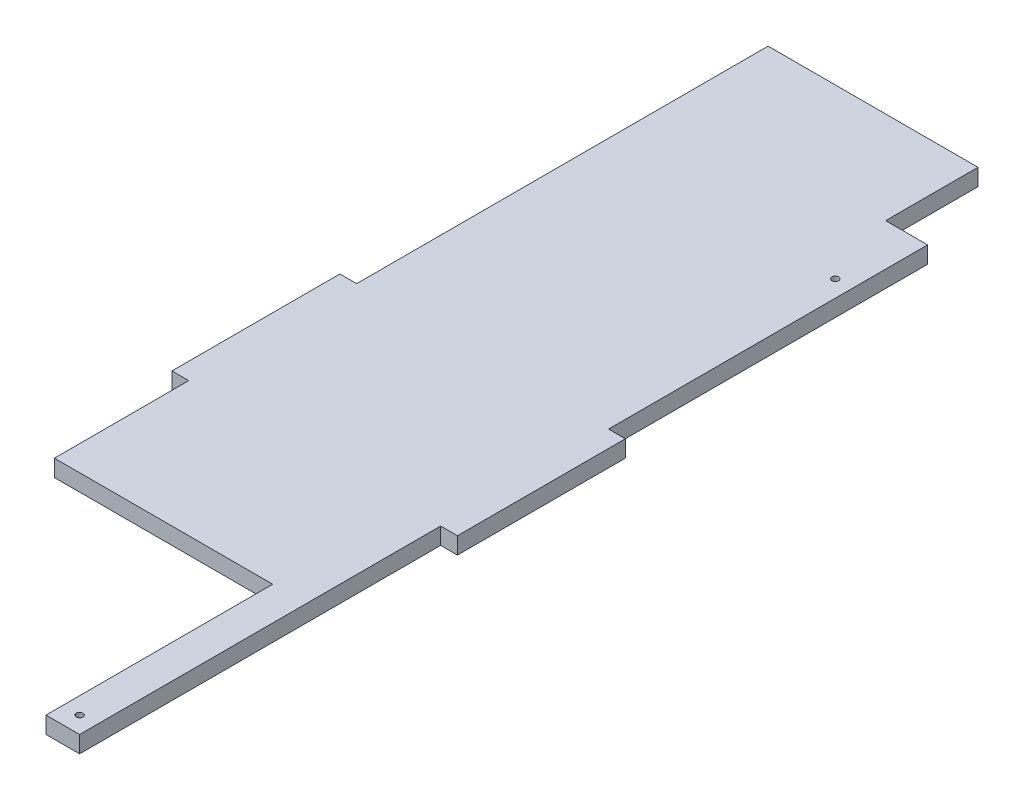
ISO-10303-21;
HEADER;
FILE_DESCRIPTION(('STEP AP214'),'2;1');
FILE_NAME('part.step','',(''),(''),'','','');
FILE_SCHEMA(('AUTOMOTIVE_DESIGN { 1 0 10303 214 1 1 1 1 }'));
ENDSEC;
DATA;
#1=APPLICATION_CONTEXT('core data for automotive mechanical design processes');
#2=APPLICATION_PROTOCOL_DEFINITION('international standard','automotive_design',2000,#1);
#3=PRODUCT_CONTEXT('',#1,'mechanical');
#4=PRODUCT('Part','Part','',(#3));
#5=PRODUCT_RELATED_PRODUCT_CATEGORY('part','',(#4));
#6=PRODUCT_DEFINITION_FORMATION('','',#4);
#7=PRODUCT_DEFINITION_CONTEXT('part definition',#1,'design');
#8=PRODUCT_DEFINITION('design','',#6,#7);
#9=PRODUCT_DEFINITION_SHAPE('','',#8);
#10=(LENGTH_UNIT() NAMED_UNIT(*) SI_UNIT(.MILLI.,.METRE.));
#11=(NAMED_UNIT(*) PLANE_ANGLE_UNIT() SI_UNIT($,.RADIAN.));
#12=(NAMED_UNIT(*) SI_UNIT($,.STERADIAN.) SOLID_ANGLE_UNIT());
#13=UNCERTAINTY_MEASURE_WITH_UNIT(LENGTH_MEASURE(1.E-05),#10,'distance_accuracy_value','');
#14=(GEOMETRIC_REPRESENTATION_CONTEXT(3) GLOBAL_UNCERTAINTY_ASSIGNED_CONTEXT((#13)) GLOBAL_UNIT_ASSIGNED_CONTEXT((#10,
#11,#12)) REPRESENTATION_CONTEXT('',''));
#15=CARTESIAN_POINT('',(0.,0.,0.));
#16=DIRECTION('',(0.,0.,1.));
#17=DIRECTION('',(1.,0.,0.));
#18=AXIS2_PLACEMENT_3D('',#15,#16,#17);
#19=CARTESIAN_POINT('',(-75.,10.,-215.));
#20=DIRECTION('',(0.,0.,-1.));
#21=DIRECTION('',(-1.,0.,0.));
#22=AXIS2_PLACEMENT_3D('',#19,#20,#21);
#23=PLANE('',#22);
#24=DIRECTION('',(1.,0.,0.));
#25=VECTOR('',#24,1.);
#26=CARTESIAN_POINT('',(-75.,0.,-215.));
#27=LINE('',#26,#25);
#28=CARTESIAN_POINT('',(-85.,0.,-215.));
#29=VERTEX_POINT('',#28);
#30=CARTESIAN_POINT('',(-75.,0.,-215.));
#31=VERTEX_POINT('',#30);
#32=EDGE_CURVE('E174',#29,#31,#27,.T.);
#33=ORIENTED_EDGE('',*,*,#32,.T.);
#34=DIRECTION('',(0.,-1.,0.));
#35=VECTOR('',#34,1.);
#36=CARTESIAN_POINT('',(-75.,10.,-215.));
#37=LINE('',#36,#35);
#38=CARTESIAN_POINT('',(-75.,10.,-215.));
#39=VERTEX_POINT('',#38);
#40=EDGE_CURVE('E11',#39,#31,#37,.T.);
#41=ORIENTED_EDGE('',*,*,#40,.F.);
#42=DIRECTION('',(1.,0.,0.));
#43=VECTOR('',#42,1.);
#44=CARTESIAN_POINT('',(-75.,10.,-215.));
#45=LINE('',#44,#43);
#46=CARTESIAN_POINT('',(-85.,10.,-215.));
#47=VERTEX_POINT('',#46);
#48=EDGE_CURVE('E203',#47,#39,#45,.T.);
#49=ORIENTED_EDGE('',*,*,#48,.F.);
#50=DIRECTION('',(0.,-1.,0.));
#51=VECTOR('',#50,1.);
#52=CARTESIAN_POINT('',(-85.,10.,-215.));
#53=LINE('',#52,#51);
#54=EDGE_CURVE('E170',#47,#29,#53,.T.);
#55=ORIENTED_EDGE('',*,*,#54,.T.);
#56=EDGE_LOOP('',(#33,#41,#49,#55));
#57=FACE_BOUND('',#56,.T.);
#58=ADVANCED_FACE('F34',(#57),#23,.F.);
#59=CARTESIAN_POINT('',(-75.,10.,-215.));
#60=DIRECTION('',(1.,0.,0.));
#61=DIRECTION('',(0.,0.,-1.));
#62=AXIS2_PLACEMENT_3D('',#59,#60,#61);
#63=PLANE('',#62);
#64=DIRECTION('',(0.,0.,1.));
#65=VECTOR('',#64,1.);
#66=CARTESIAN_POINT('',(-75.,0.,-215.));
#67=LINE('',#66,#65);
#68=CARTESIAN_POINT('',(-75.,0.,-135.));
#69=VERTEX_POINT('',#68);
#70=EDGE_CURVE('E177',#31,#69,#67,.T.);
#71=ORIENTED_EDGE('',*,*,#70,.T.);
#72=DIRECTION('',(0.,-1.,0.));
#73=VECTOR('',#72,1.);
#74=CARTESIAN_POINT('',(-75.,10.,-135.));
#75=LINE('',#74,#73);
#76=CARTESIAN_POINT('',(-75.,10.,-135.));
#77=VERTEX_POINT('',#76);
#78=EDGE_CURVE('E41',#77,#69,#75,.T.);
#79=ORIENTED_EDGE('',*,*,#78,.F.);
#80=DIRECTION('',(0.,0.,1.));
#81=VECTOR('',#80,1.);
#82=CARTESIAN_POINT('',(-75.,10.,-215.));
#83=LINE('',#82,#81);
#84=EDGE_CURVE('E113',#39,#77,#83,.T.);
#85=ORIENTED_EDGE('',*,*,#84,.F.);
#86=ORIENTED_EDGE('',*,*,#40,.T.);
#87=EDGE_LOOP('',(#71,#79,#85,#86));
#88=FACE_BOUND('',#87,.T.);
#89=ADVANCED_FACE('F303',(#88),#63,.F.);
#90=CARTESIAN_POINT('',(55.,10.,-135.));
#91=DIRECTION('',(0.,0.,-1.));
#92=DIRECTION('',(-1.,0.,0.));
#93=AXIS2_PLACEMENT_3D('',#90,#91,#92);
#94=PLANE('',#93);
#95=DIRECTION('',(1.,0.,0.));
#96=VECTOR('',#95,1.);
#97=CARTESIAN_POINT('',(55.,0.,-135.));
#98=LINE('',#97,#96);
#99=CARTESIAN_POINT('',(55.,0.,-135.));
#100=VERTEX_POINT('',#99);
#101=EDGE_CURVE('E180',#69,#100,#98,.T.);
#102=ORIENTED_EDGE('',*,*,#101,.T.);
#103=DIRECTION('',(0.,-1.,0.));
#104=VECTOR('',#103,1.);
#105=CARTESIAN_POINT('',(55.,10.,-135.));
#106=LINE('',#105,#104);
#107=CARTESIAN_POINT('',(55.,10.,-135.));
#108=VERTEX_POINT('',#107);
#109=EDGE_CURVE('E225',#108,#100,#106,.T.);
#110=ORIENTED_EDGE('',*,*,#109,.F.);
#111=DIRECTION('',(1.,0.,0.));
#112=VECTOR('',#111,1.);
#113=CARTESIAN_POINT('',(55.,10.,-135.));
#114=LINE('',#113,#112);
#115=EDGE_CURVE('E233',#77,#108,#114,.T.);
#116=ORIENTED_EDGE('',*,*,#115,.F.);
#117=ORIENTED_EDGE('',*,*,#78,.T.);
#118=EDGE_LOOP('',(#102,#110,#116,#117));
#119=FACE_BOUND('',#118,.T.);
#120=ADVANCED_FACE('F231',(#119),#94,.F.);
#121=CARTESIAN_POINT('',(55.,10.,0.));
#122=DIRECTION('',(1.,0.,0.));
#123=DIRECTION('',(0.,0.,-1.));
#124=AXIS2_PLACEMENT_3D('',#121,#122,#123);
#125=PLANE('',#124);
#126=DIRECTION('',(0.,0.,1.));
#127=VECTOR('',#126,1.);
#128=CARTESIAN_POINT('',(55.,0.,0.));
#129=LINE('',#128,#127);
#130=CARTESIAN_POINT('',(55.,0.,0.));
#131=VERTEX_POINT('',#130);
#132=EDGE_CURVE('E182',#100,#131,#129,.T.);
#133=ORIENTED_EDGE('',*,*,#132,.T.);
#134=DIRECTION('',(0.,-1.,0.));
#135=VECTOR('',#134,1.);
#136=CARTESIAN_POINT('',(55.,10.,0.));
#137=LINE('',#136,#135);
#138=CARTESIAN_POINT('',(55.,10.,0.));
#139=VERTEX_POINT('',#138);
#140=EDGE_CURVE('E222',#139,#131,#137,.T.);
#141=ORIENTED_EDGE('',*,*,#140,.F.);
#142=DIRECTION('',(0.,0.,1.));
#143=VECTOR('',#142,1.);
#144=CARTESIAN_POINT('',(55.,10.,0.));
#145=LINE('',#144,#143);
#146=EDGE_CURVE('E252',#108,#139,#145,.T.);
#147=ORIENTED_EDGE('',*,*,#146,.F.);
#148=ORIENTED_EDGE('',*,*,#109,.T.);
#149=EDGE_LOOP('',(#133,#141,#147,#148));
#150=FACE_BOUND('',#149,.T.);
#151=ADVANCED_FACE('F243',(#150),#125,.F.);
#152=CARTESIAN_POINT('',(75.,10.,0.));
#153=DIRECTION('',(0.,0.,-1.));
#154=DIRECTION('',(-1.,0.,0.));
#155=AXIS2_PLACEMENT_3D('',#152,#153,#154);
#156=PLANE('',#155);
#157=DIRECTION('',(1.,0.,0.));
#158=VECTOR('',#157,1.);
#159=CARTESIAN_POINT('',(75.,0.,0.));
#160=LINE('',#159,#158);
#161=CARTESIAN_POINT('',(75.,0.,0.));
#162=VERTEX_POINT('',#161);
#163=EDGE_CURVE('E184',#131,#162,#160,.T.);
#164=ORIENTED_EDGE('',*,*,#163,.T.);
#165=DIRECTION('',(0.,-1.,0.));
#166=VECTOR('',#165,1.);
#167=CARTESIAN_POINT('',(75.,10.,0.));
#168=LINE('',#167,#166);
#169=CARTESIAN_POINT('',(75.,10.,0.));
#170=VERTEX_POINT('',#169);
#171=EDGE_CURVE('E219',#170,#162,#168,.T.);
#172=ORIENTED_EDGE('',*,*,#171,.F.);
#173=DIRECTION('',(1.,0.,0.));
#174=VECTOR('',#173,1.);
#175=CARTESIAN_POINT('',(75.,10.,0.));
#176=LINE('',#175,#174);
#177=EDGE_CURVE('E249',#139,#170,#176,.T.);
#178=ORIENTED_EDGE('',*,*,#177,.F.);
#179=ORIENTED_EDGE('',*,*,#140,.T.);
#180=EDGE_LOOP('',(#164,#172,#178,#179));
#181=FACE_BOUND('',#180,.T.);
#182=ADVANCED_FACE('F247',(#181),#156,.F.);
#183=CARTESIAN_POINT('',(75.,10.,-215.));
#184=DIRECTION('',(-1.,0.,0.));
#185=DIRECTION('',(0.,0.,1.));
#186=AXIS2_PLACEMENT_3D('',#183,#184,#185);
#187=PLANE('',#186);
#188=DIRECTION('',(0.,0.,-1.));
#189=VECTOR('',#188,1.);
#190=CARTESIAN_POINT('',(75.,0.,-215.));
#191=LINE('',#190,#189);
#192=CARTESIAN_POINT('',(75.,0.,-215.));
#193=VERTEX_POINT('',#192);
#194=EDGE_CURVE('E186',#162,#193,#191,.T.);
#195=ORIENTED_EDGE('',*,*,#194,.T.);
#196=DIRECTION('',(0.,-1.,0.));
#197=VECTOR('',#196,1.);
#198=CARTESIAN_POINT('',(75.,10.,-215.));
#199=LINE('',#198,#197);
#200=CARTESIAN_POINT('',(75.,10.,-215.));
#201=VERTEX_POINT('',#200);
#202=EDGE_CURVE('E216',#201,#193,#199,.T.);
#203=ORIENTED_EDGE('',*,*,#202,.F.);
#204=DIRECTION('',(0.,0.,-1.));
#205=VECTOR('',#204,1.);
#206=CARTESIAN_POINT('',(75.,10.,-215.));
#207=LINE('',#206,#205);
#208=EDGE_CURVE('E251',#170,#201,#207,.T.);
#209=ORIENTED_EDGE('',*,*,#208,.F.);
#210=ORIENTED_EDGE('',*,*,#171,.T.);
#211=EDGE_LOOP('',(#195,#203,#209,#210));
#212=FACE_BOUND('',#211,.T.);
#213=ADVANCED_FACE('F315',(#212),#187,.F.);
#214=CARTESIAN_POINT('',(75.,10.,-215.));
#215=DIRECTION('',(0.,0.,-1.));
#216=DIRECTION('',(-1.,0.,0.));
#217=AXIS2_PLACEMENT_3D('',#214,#215,#216);
#218=PLANE('',#217);
#219=DIRECTION('',(1.,0.,0.));
#220=VECTOR('',#219,1.);
#221=CARTESIAN_POINT('',(75.,0.,-215.));
#222=LINE('',#221,#220);
#223=CARTESIAN_POINT('',(85.,0.,-215.));
#224=VERTEX_POINT('',#223);
#225=EDGE_CURVE('E188',#193,#224,#222,.T.);
#226=ORIENTED_EDGE('',*,*,#225,.T.);
#227=DIRECTION('',(0.,-1.,0.));
#228=VECTOR('',#227,1.);
#229=CARTESIAN_POINT('',(85.,10.,-215.));
#230=LINE('',#229,#228);
#231=CARTESIAN_POINT('',(85.,10.,-215.));
#232=VERTEX_POINT('',#231);
#233=EDGE_CURVE('E213',#232,#224,#230,.T.);
#234=ORIENTED_EDGE('',*,*,#233,.F.);
#235=DIRECTION('',(1.,0.,0.));
#236=VECTOR('',#235,1.);
#237=CARTESIAN_POINT('',(75.,10.,-215.));
#238=LINE('',#237,#236);
#239=EDGE_CURVE('E254',#201,#232,#238,.T.);
#240=ORIENTED_EDGE('',*,*,#239,.F.);
#241=ORIENTED_EDGE('',*,*,#202,.T.);
#242=EDGE_LOOP('',(#226,#234,#240,#241));
#243=FACE_BOUND('',#242,.T.);
#244=ADVANCED_FACE('F318',(#243),#218,.F.);
#245=CARTESIAN_POINT('',(85.,10.,-215.));
#246=DIRECTION('',(-1.,0.,0.));
#247=DIRECTION('',(0.,0.,1.));
#248=AXIS2_PLACEMENT_3D('',#245,#246,#247);
#249=PLANE('',#248);
#250=DIRECTION('',(0.,0.,-1.));
#251=VECTOR('',#250,1.);
#252=CARTESIAN_POINT('',(85.,0.,-215.));
#253=LINE('',#252,#251);
#254=CARTESIAN_POINT('',(85.,0.,-315.));
#255=VERTEX_POINT('',#254);
#256=EDGE_CURVE('E190',#224,#255,#253,.T.);
#257=ORIENTED_EDGE('',*,*,#256,.T.);
#258=DIRECTION('',(0.,-1.,0.));
#259=VECTOR('',#258,1.);
#260=CARTESIAN_POINT('',(85.,10.,-315.));
#261=LINE('',#260,#259);
#262=CARTESIAN_POINT('',(85.,10.,-315.));
#263=VERTEX_POINT('',#262);
#264=EDGE_CURVE('E210',#263,#255,#261,.T.);
#265=ORIENTED_EDGE('',*,*,#264,.F.);
#266=DIRECTION('',(0.,0.,-1.));
#267=VECTOR('',#266,1.);
#268=CARTESIAN_POINT('',(85.,10.,-215.));
#269=LINE('',#268,#267);
#270=EDGE_CURVE('E260',#232,#263,#269,.T.);
#271=ORIENTED_EDGE('',*,*,#270,.F.);
#272=ORIENTED_EDGE('',*,*,#233,.T.);
#273=EDGE_LOOP('',(#257,#265,#271,#272));
#274=FACE_BOUND('',#273,.T.);
#275=ADVANCED_FACE('F322',(#274),#249,.F.);
#276=CARTESIAN_POINT('',(85.,10.,-315.));
#277=DIRECTION('',(0.,0.,1.));
#278=DIRECTION('',(1.,0.,0.));
#279=AXIS2_PLACEMENT_3D('',#276,#277,#278);
#280=PLANE('',#279);
#281=DIRECTION('',(-1.,0.,0.));
#282=VECTOR('',#281,1.);
#283=CARTESIAN_POINT('',(85.,0.,-315.));
#284=LINE('',#283,#282);
#285=CARTESIAN_POINT('',(75.,0.,-315.));
#286=VERTEX_POINT('',#285);
#287=EDGE_CURVE('E192',#255,#286,#284,.T.);
#288=ORIENTED_EDGE('',*,*,#287,.T.);
#289=DIRECTION('',(0.,-1.,0.));
#290=VECTOR('',#289,1.);
#291=CARTESIAN_POINT('',(75.,10.,-315.));
#292=LINE('',#291,#290);
#293=CARTESIAN_POINT('',(75.,10.,-315.));
#294=VERTEX_POINT('',#293);
#295=EDGE_CURVE('E207',#294,#286,#292,.T.);
#296=ORIENTED_EDGE('',*,*,#295,.F.);
#297=DIRECTION('',(-1.,0.,0.));
#298=VECTOR('',#297,1.);
#299=CARTESIAN_POINT('',(85.,10.,-315.));
#300=LINE('',#299,#298);
#301=EDGE_CURVE('E262',#263,#294,#300,.T.);
#302=ORIENTED_EDGE('',*,*,#301,.F.);
#303=ORIENTED_EDGE('',*,*,#264,.T.);
#304=EDGE_LOOP('',(#288,#296,#302,#303));
#305=FACE_BOUND('',#304,.T.);
#306=ADVANCED_FACE('F326',(#305),#280,.F.);
#307=CARTESIAN_POINT('',(75.,10.,-315.));
#308=DIRECTION('',(-1.,0.,0.));
#309=DIRECTION('',(0.,0.,1.));
#310=AXIS2_PLACEMENT_3D('',#307,#308,#309);
#311=PLANE('',#310);
#312=DIRECTION('',(0.,0.,-1.));
#313=VECTOR('',#312,1.);
#314=CARTESIAN_POINT('',(75.,0.,-315.));
#315=LINE('',#314,#313);
#316=CARTESIAN_POINT('',(75.,0.,-505.));
#317=VERTEX_POINT('',#316);
#318=EDGE_CURVE('E194',#286,#317,#315,.T.);
#319=ORIENTED_EDGE('',*,*,#318,.T.);
#320=DIRECTION('',(0.,1.,0.));
#321=VECTOR('',#320,1.);
#322=CARTESIAN_POINT('',(75.,0.,-505.));
#323=LINE('',#322,#321);
#324=CARTESIAN_POINT('',(75.,10.,-505.));
#325=VERTEX_POINT('',#324);
#326=EDGE_CURVE('E178',#317,#325,#323,.T.);
#327=ORIENTED_EDGE('',*,*,#326,.T.);
#328=DIRECTION('',(0.,0.,-1.));
#329=VECTOR('',#328,1.);
#330=CARTESIAN_POINT('',(75.,10.,-315.));
#331=LINE('',#330,#329);
#332=EDGE_CURVE('E264',#294,#325,#331,.T.);
#333=ORIENTED_EDGE('',*,*,#332,.F.);
#334=ORIENTED_EDGE('',*,*,#295,.T.);
#335=EDGE_LOOP('',(#319,#327,#333,#334));
#336=FACE_BOUND('',#335,.T.);
#337=ADVANCED_FACE('F275',(#336),#311,.F.);
#338=CARTESIAN_POINT('',(-75.,10.,-560.));
#339=DIRECTION('',(0.,0.,1.));
#340=DIRECTION('',(1.,0.,0.));
#341=AXIS2_PLACEMENT_3D('',#338,#339,#340);
#342=PLANE('',#341);
#343=DIRECTION('',(-1.,0.,0.));
#344=VECTOR('',#343,1.);
#345=CARTESIAN_POINT('',(-75.,10.,-560.));
#346=LINE('',#345,#344);
#347=CARTESIAN_POINT('',(50.,10.,-560.));
#348=VERTEX_POINT('',#347);
#349=CARTESIAN_POINT('',(-75.,10.,-560.));
#350=VERTEX_POINT('',#349);
#351=EDGE_CURVE('E153',#348,#350,#346,.T.);
#352=ORIENTED_EDGE('',*,*,#351,.F.);
#353=DIRECTION('',(0.,1.,0.));
#354=VECTOR('',#353,1.);
#355=CARTESIAN_POINT('',(50.,0.,-560.));
#356=LINE('',#355,#354);
#357=CARTESIAN_POINT('',(50.,0.,-560.));
#358=VERTEX_POINT('',#357);
#359=EDGE_CURVE('E279',#358,#348,#356,.T.);
#360=ORIENTED_EDGE('',*,*,#359,.F.);
#361=DIRECTION('',(-1.,0.,0.));
#362=VECTOR('',#361,1.);
#363=CARTESIAN_POINT('',(-75.,0.,-560.));
#364=LINE('',#363,#362);
#365=CARTESIAN_POINT('',(-75.,0.,-560.));
#366=VERTEX_POINT('',#365);
#367=EDGE_CURVE('E197',#358,#366,#364,.T.);
#368=ORIENTED_EDGE('',*,*,#367,.T.);
#369=DIRECTION('',(0.,-1.,0.));
#370=VECTOR('',#369,1.);
#371=CARTESIAN_POINT('',(-75.,10.,-560.));
#372=LINE('',#371,#370);
#373=EDGE_CURVE('E165',#350,#366,#372,.T.);
#374=ORIENTED_EDGE('',*,*,#373,.F.);
#375=EDGE_LOOP('',(#352,#360,#368,#374));
#376=FACE_BOUND('',#375,.T.);
#377=ADVANCED_FACE('F333',(#376),#342,.F.);
#378=CARTESIAN_POINT('',(-75.,10.,-315.));
#379=DIRECTION('',(1.,0.,0.));
#380=DIRECTION('',(0.,0.,-1.));
#381=AXIS2_PLACEMENT_3D('',#378,#379,#380);
#382=PLANE('',#381);
#383=DIRECTION('',(0.,0.,1.));
#384=VECTOR('',#383,1.);
#385=CARTESIAN_POINT('',(-75.,0.,-315.));
#386=LINE('',#385,#384);
#387=CARTESIAN_POINT('',(-75.,0.,-315.));
#388=VERTEX_POINT('',#387);
#389=EDGE_CURVE('E162',#366,#388,#386,.T.);
#390=ORIENTED_EDGE('',*,*,#389,.T.);
#391=DIRECTION('',(0.,-1.,0.));
#392=VECTOR('',#391,1.);
#393=CARTESIAN_POINT('',(-75.,10.,-315.));
#394=LINE('',#393,#392);
#395=CARTESIAN_POINT('',(-75.,10.,-315.));
#396=VERTEX_POINT('',#395);
#397=EDGE_CURVE('E159',#396,#388,#394,.T.);
#398=ORIENTED_EDGE('',*,*,#397,.F.);
#399=DIRECTION('',(0.,0.,1.));
#400=VECTOR('',#399,1.);
#401=CARTESIAN_POINT('',(-75.,10.,-315.));
#402=LINE('',#401,#400);
#403=EDGE_CURVE('E144',#350,#396,#402,.T.);
#404=ORIENTED_EDGE('',*,*,#403,.F.);
#405=ORIENTED_EDGE('',*,*,#373,.T.);
#406=EDGE_LOOP('',(#390,#398,#404,#405));
#407=FACE_BOUND('',#406,.T.);
#408=ADVANCED_FACE('F160',(#407),#382,.F.);
#409=CARTESIAN_POINT('',(-85.,10.,-315.));
#410=DIRECTION('',(0.,0.,1.));
#411=DIRECTION('',(1.,0.,0.));
#412=AXIS2_PLACEMENT_3D('',#409,#410,#411);
#413=PLANE('',#412);
#414=DIRECTION('',(-1.,0.,0.));
#415=VECTOR('',#414,1.);
#416=CARTESIAN_POINT('',(-85.,0.,-315.));
#417=LINE('',#416,#415);
#418=CARTESIAN_POINT('',(-85.,0.,-315.));
#419=VERTEX_POINT('',#418);
#420=EDGE_CURVE('E200',#388,#419,#417,.T.);
#421=ORIENTED_EDGE('',*,*,#420,.T.);
#422=DIRECTION('',(0.,-1.,0.));
#423=VECTOR('',#422,1.);
#424=CARTESIAN_POINT('',(-85.,10.,-315.));
#425=LINE('',#424,#423);
#426=CARTESIAN_POINT('',(-85.,10.,-315.));
#427=VERTEX_POINT('',#426);
#428=EDGE_CURVE('E166',#427,#419,#425,.T.);
#429=ORIENTED_EDGE('',*,*,#428,.F.);
#430=DIRECTION('',(-1.,0.,0.));
#431=VECTOR('',#430,1.);
#432=CARTESIAN_POINT('',(-85.,10.,-315.));
#433=LINE('',#432,#431);
#434=EDGE_CURVE('E149',#396,#427,#433,.T.);
#435=ORIENTED_EDGE('',*,*,#434,.F.);
#436=ORIENTED_EDGE('',*,*,#397,.T.);
#437=EDGE_LOOP('',(#421,#429,#435,#436));
#438=FACE_BOUND('',#437,.T.);
#439=ADVANCED_FACE('F168',(#438),#413,.F.);
#440=CARTESIAN_POINT('',(-85.,10.,-215.));
#441=DIRECTION('',(1.,0.,0.));
#442=DIRECTION('',(0.,0.,-1.));
#443=AXIS2_PLACEMENT_3D('',#440,#441,#442);
#444=PLANE('',#443);
#445=DIRECTION('',(0.,0.,1.));
#446=VECTOR('',#445,1.);
#447=CARTESIAN_POINT('',(-85.,0.,-215.));
#448=LINE('',#447,#446);
#449=EDGE_CURVE('E105',#419,#29,#448,.T.);
#450=ORIENTED_EDGE('',*,*,#449,.T.);
#451=ORIENTED_EDGE('',*,*,#54,.F.);
#452=DIRECTION('',(0.,0.,1.));
#453=VECTOR('',#452,1.);
#454=CARTESIAN_POINT('',(-85.,10.,-215.));
#455=LINE('',#454,#453);
#456=EDGE_CURVE('E57',#427,#47,#455,.T.);
#457=ORIENTED_EDGE('',*,*,#456,.F.);
#458=ORIENTED_EDGE('',*,*,#428,.T.);
#459=EDGE_LOOP('',(#450,#451,#457,#458));
#460=FACE_BOUND('',#459,.T.);
#461=ADVANCED_FACE('F341',(#460),#444,.F.);
#462=CARTESIAN_POINT('',(0.,10.,0.));
#463=DIRECTION('',(0.,-1.,0.));
#464=DIRECTION('',(0.,0.,-1.));
#465=AXIS2_PLACEMENT_3D('',#462,#463,#464);
#466=PLANE('',#465);
#467=CARTESIAN_POINT('',(65.,10.,-460.));
#468=DIRECTION('',(0.,1.,0.));
#469=DIRECTION('',(0.,0.,1.));
#470=AXIS2_PLACEMENT_3D('',#467,#468,#469);
#471=CIRCLE('',#470,2.);
#472=CARTESIAN_POINT('',(65.,10.,-458.));
#473=VERTEX_POINT('',#472);
#474=EDGE_CURVE('E290',#473,#473,#471,.T.);
#475=ORIENTED_EDGE('',*,*,#474,.F.);
#476=EDGE_LOOP('',(#475));
#477=FACE_BOUND('',#476,.T.);
#478=CARTESIAN_POINT('',(65.,10.,-10.));
#479=DIRECTION('',(0.,1.,0.));
#480=DIRECTION('',(0.,0.,1.));
#481=AXIS2_PLACEMENT_3D('',#478,#479,#480);
#482=CIRCLE('',#481,2.);
#483=CARTESIAN_POINT('',(65.,10.,-8.));
#484=VERTEX_POINT('',#483);
#485=EDGE_CURVE('E296',#484,#484,#482,.T.);
#486=ORIENTED_EDGE('',*,*,#485,.F.);
#487=EDGE_LOOP('',(#486));
#488=FACE_BOUND('',#487,.T.);
#489=ORIENTED_EDGE('',*,*,#332,.T.);
#490=DIRECTION('',(1.,0.,0.));
#491=VECTOR('',#490,1.);
#492=CARTESIAN_POINT('',(75.,10.,-505.));
#493=LINE('',#492,#491);
#494=CARTESIAN_POINT('',(50.,10.,-505.));
#495=VERTEX_POINT('',#494);
#496=EDGE_CURVE('E269',#495,#325,#493,.T.);
#497=ORIENTED_EDGE('',*,*,#496,.F.);
#498=DIRECTION('',(0.,0.,1.));
#499=VECTOR('',#498,1.);
#500=CARTESIAN_POINT('',(50.,10.,-560.));
#501=LINE('',#500,#499);
#502=EDGE_CURVE('E289',#348,#495,#501,.T.);
#503=ORIENTED_EDGE('',*,*,#502,.F.);
#504=ORIENTED_EDGE('',*,*,#351,.T.);
#505=ORIENTED_EDGE('',*,*,#403,.T.);
#506=ORIENTED_EDGE('',*,*,#434,.T.);
#507=ORIENTED_EDGE('',*,*,#456,.T.);
#508=ORIENTED_EDGE('',*,*,#48,.T.);
#509=ORIENTED_EDGE('',*,*,#84,.T.);
#510=ORIENTED_EDGE('',*,*,#115,.T.);
#511=ORIENTED_EDGE('',*,*,#146,.T.);
#512=ORIENTED_EDGE('',*,*,#177,.T.);
#513=ORIENTED_EDGE('',*,*,#208,.T.);
#514=ORIENTED_EDGE('',*,*,#239,.T.);
#515=ORIENTED_EDGE('',*,*,#270,.T.);
#516=ORIENTED_EDGE('',*,*,#301,.T.);
#517=EDGE_LOOP('',(#489,#497,#503,#504,#505,#506,#507,#508,#509,#510,#511,#512,#513,#514,#515,#516));
#518=FACE_BOUND('',#517,.T.);
#519=ADVANCED_FACE('F147',(#477,#488,#518),#466,.F.);
#520=CARTESIAN_POINT('',(0.,0.,0.));
#521=DIRECTION('',(0.,-1.,0.));
#522=DIRECTION('',(0.,0.,-1.));
#523=AXIS2_PLACEMENT_3D('',#520,#521,#522);
#524=PLANE('',#523);
#525=DIRECTION('',(1.,0.,0.));
#526=VECTOR('',#525,1.);
#527=CARTESIAN_POINT('',(75.,0.,-505.));
#528=LINE('',#527,#526);
#529=CARTESIAN_POINT('',(50.,0.,-505.));
#530=VERTEX_POINT('',#529);
#531=EDGE_CURVE('E48',#530,#317,#528,.T.);
#532=ORIENTED_EDGE('',*,*,#531,.T.);
#533=ORIENTED_EDGE('',*,*,#318,.F.);
#534=ORIENTED_EDGE('',*,*,#287,.F.);
#535=ORIENTED_EDGE('',*,*,#256,.F.);
#536=ORIENTED_EDGE('',*,*,#225,.F.);
#537=ORIENTED_EDGE('',*,*,#194,.F.);
#538=ORIENTED_EDGE('',*,*,#163,.F.);
#539=ORIENTED_EDGE('',*,*,#132,.F.);
#540=ORIENTED_EDGE('',*,*,#101,.F.);
#541=ORIENTED_EDGE('',*,*,#70,.F.);
#542=ORIENTED_EDGE('',*,*,#32,.F.);
#543=ORIENTED_EDGE('',*,*,#449,.F.);
#544=ORIENTED_EDGE('',*,*,#420,.F.);
#545=ORIENTED_EDGE('',*,*,#389,.F.);
#546=ORIENTED_EDGE('',*,*,#367,.F.);
#547=DIRECTION('',(0.,0.,1.));
#548=VECTOR('',#547,1.);
#549=CARTESIAN_POINT('',(50.,0.,-560.));
#550=LINE('',#549,#548);
#551=EDGE_CURVE('E366',#358,#530,#550,.T.);
#552=ORIENTED_EDGE('',*,*,#551,.T.);
#553=EDGE_LOOP('',(#532,#533,#534,#535,#536,#537,#538,#539,#540,#541,#542,#543,#544,#545,#546,#552));
#554=FACE_BOUND('',#553,.T.);
#555=CARTESIAN_POINT('',(65.,0.,-460.));
#556=DIRECTION('',(0.,1.,0.));
#557=DIRECTION('',(0.,0.,1.));
#558=AXIS2_PLACEMENT_3D('',#555,#556,#557);
#559=CIRCLE('',#558,2.);
#560=CARTESIAN_POINT('',(65.,0.,-458.));
#561=VERTEX_POINT('',#560);
#562=EDGE_CURVE('E286',#561,#561,#559,.T.);
#563=ORIENTED_EDGE('',*,*,#562,.T.);
#564=EDGE_LOOP('',(#563));
#565=FACE_BOUND('',#564,.T.);
#566=CARTESIAN_POINT('',(65.,0.,-10.));
#567=DIRECTION('',(0.,1.,0.));
#568=DIRECTION('',(0.,0.,1.));
#569=AXIS2_PLACEMENT_3D('',#566,#567,#568);
#570=CIRCLE('',#569,2.);
#571=CARTESIAN_POINT('',(65.,0.,-8.));
#572=VERTEX_POINT('',#571);
#573=EDGE_CURVE('E293',#572,#572,#570,.T.);
#574=ORIENTED_EDGE('',*,*,#573,.T.);
#575=EDGE_LOOP('',(#574));
#576=FACE_BOUND('',#575,.T.);
#577=ADVANCED_FACE('F236',(#554,#565,#576),#524,.T.);
#578=CARTESIAN_POINT('',(65.,0.,-10.));
#579=DIRECTION('',(0.,1.,0.));
#580=DIRECTION('',(0.,0.,1.));
#581=AXIS2_PLACEMENT_3D('',#578,#579,#580);
#582=CYLINDRICAL_SURFACE('',#581,2.);
#583=ORIENTED_EDGE('',*,*,#573,.F.);
#584=EDGE_LOOP('',(#583));
#585=FACE_BOUND('',#584,.T.);
#586=ORIENTED_EDGE('',*,*,#485,.T.);
#587=EDGE_LOOP('',(#586));
#588=FACE_BOUND('',#587,.T.);
#589=ADVANCED_FACE('F346',(#585,#588),#582,.F.);
#590=CARTESIAN_POINT('',(65.,0.,-460.));
#591=DIRECTION('',(0.,1.,0.));
#592=DIRECTION('',(0.,0.,1.));
#593=AXIS2_PLACEMENT_3D('',#590,#591,#592);
#594=CYLINDRICAL_SURFACE('',#593,2.);
#595=ORIENTED_EDGE('',*,*,#562,.F.);
#596=EDGE_LOOP('',(#595));
#597=FACE_BOUND('',#596,.T.);
#598=ORIENTED_EDGE('',*,*,#474,.T.);
#599=EDGE_LOOP('',(#598));
#600=FACE_BOUND('',#599,.T.);
#601=ADVANCED_FACE('F352',(#597,#600),#594,.F.);
#602=CARTESIAN_POINT('',(75.,0.,-505.));
#603=DIRECTION('',(0.,0.,1.));
#604=DIRECTION('',(1.,0.,0.));
#605=AXIS2_PLACEMENT_3D('',#602,#603,#604);
#606=PLANE('',#605);
#607=ORIENTED_EDGE('',*,*,#496,.T.);
#608=ORIENTED_EDGE('',*,*,#326,.F.);
#609=ORIENTED_EDGE('',*,*,#531,.F.);
#610=DIRECTION('',(0.,1.,0.));
#611=VECTOR('',#610,1.);
#612=CARTESIAN_POINT('',(50.,0.,-505.));
#613=LINE('',#612,#611);
#614=EDGE_CURVE('E277',#530,#495,#613,.T.);
#615=ORIENTED_EDGE('',*,*,#614,.T.);
#616=EDGE_LOOP('',(#607,#608,#609,#615));
#617=FACE_BOUND('',#616,.T.);
#618=ADVANCED_FACE('F356',(#617),#606,.F.);
#619=CARTESIAN_POINT('',(50.,0.,-560.));
#620=DIRECTION('',(-1.,0.,0.));
#621=DIRECTION('',(0.,0.,1.));
#622=AXIS2_PLACEMENT_3D('',#619,#620,#621);
#623=PLANE('',#622);
#624=ORIENTED_EDGE('',*,*,#502,.T.);
#625=ORIENTED_EDGE('',*,*,#614,.F.);
#626=ORIENTED_EDGE('',*,*,#551,.F.);
#627=ORIENTED_EDGE('',*,*,#359,.T.);
#628=EDGE_LOOP('',(#624,#625,#626,#627));
#629=FACE_BOUND('',#628,.T.);
#630=ADVANCED_FACE('F358',(#629),#623,.F.);
#631=CLOSED_SHELL('',(#58,#89,#120,#151,#182,#213,#244,#275,#306,#337,#377,#408,#439,#461,#519,
#577,#589,#601,#618,#630));
#632=MANIFOLD_SOLID_BREP('B2',#631);
#633=ADVANCED_BREP_SHAPE_REPRESENTATION('',(#18,#632),#14);
#634=SHAPE_DEFINITION_REPRESENTATION(#9,#633);
ENDSEC;
END-ISO-10303-21;
